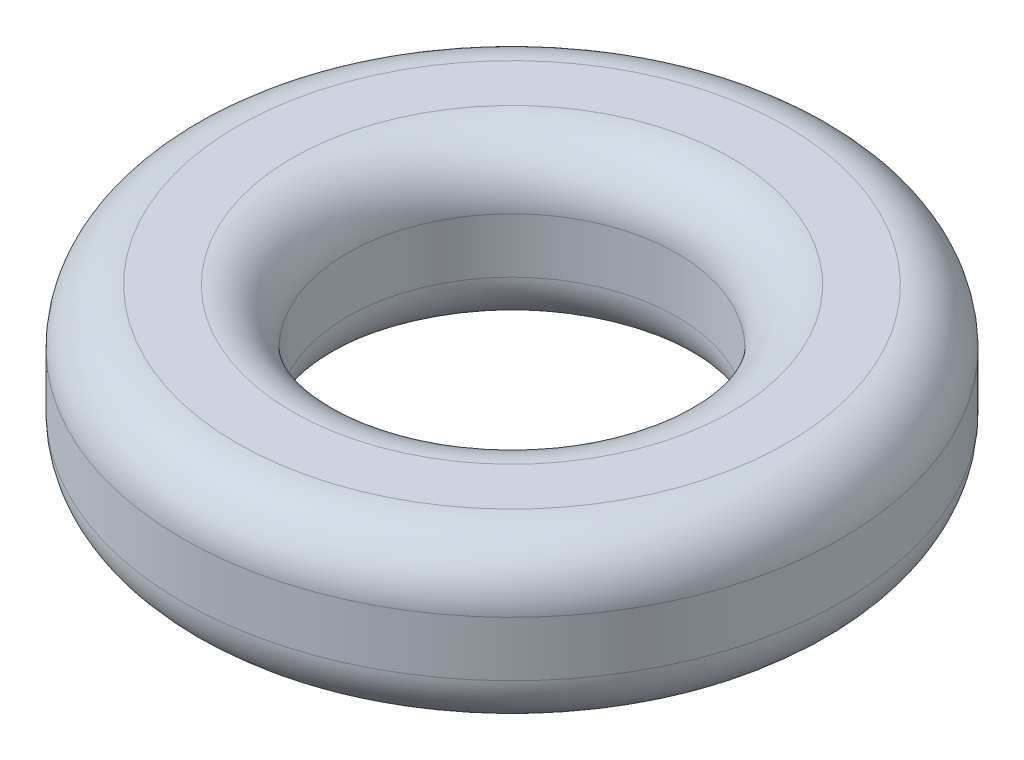
ISO-10303-21;
HEADER;
FILE_DESCRIPTION(('STEP AP214'),'2;1');
FILE_NAME('part.step','',(''),(''),'','','');
FILE_SCHEMA(('AUTOMOTIVE_DESIGN { 1 0 10303 214 1 1 1 1 }'));
ENDSEC;
DATA;
#1=APPLICATION_CONTEXT('core data for automotive mechanical design processes');
#2=APPLICATION_PROTOCOL_DEFINITION('international standard','automotive_design',2000,#1);
#3=PRODUCT_CONTEXT('',#1,'mechanical');
#4=PRODUCT('Part','Part','',(#3));
#5=PRODUCT_RELATED_PRODUCT_CATEGORY('part','',(#4));
#6=PRODUCT_DEFINITION_FORMATION('','',#4);
#7=PRODUCT_DEFINITION_CONTEXT('part definition',#1,'design');
#8=PRODUCT_DEFINITION('design','',#6,#7);
#9=PRODUCT_DEFINITION_SHAPE('','',#8);
#10=(LENGTH_UNIT() NAMED_UNIT(*) SI_UNIT(.MILLI.,.METRE.));
#11=(NAMED_UNIT(*) PLANE_ANGLE_UNIT() SI_UNIT($,.RADIAN.));
#12=(NAMED_UNIT(*) SI_UNIT($,.STERADIAN.) SOLID_ANGLE_UNIT());
#13=UNCERTAINTY_MEASURE_WITH_UNIT(LENGTH_MEASURE(1.E-05),#10,'distance_accuracy_value','');
#14=(GEOMETRIC_REPRESENTATION_CONTEXT(3) GLOBAL_UNCERTAINTY_ASSIGNED_CONTEXT((#13)) GLOBAL_UNIT_ASSIGNED_CONTEXT((#10,
#11,#12)) REPRESENTATION_CONTEXT('',''));
#15=CARTESIAN_POINT('',(0.,0.,0.));
#16=DIRECTION('',(0.,0.,1.));
#17=DIRECTION('',(1.,0.,0.));
#18=AXIS2_PLACEMENT_3D('',#15,#16,#17);
#19=CARTESIAN_POINT('',(0.,0.75,0.));
#20=DIRECTION('',(0.,1.,0.));
#21=DIRECTION('',(0.,0.,1.));
#22=AXIS2_PLACEMENT_3D('',#19,#20,#21);
#23=PLANE('',#22);
#24=CARTESIAN_POINT('',(0.,0.75,0.));
#25=DIRECTION('',(0.,1.,0.));
#26=DIRECTION('',(0.,0.,1.));
#27=AXIS2_PLACEMENT_3D('',#24,#25,#26);
#28=CIRCLE('',#27,2.);
#29=CARTESIAN_POINT('',(0.,0.75,2.));
#30=VERTEX_POINT('',#29);
#31=EDGE_CURVE('E10',#30,#30,#28,.F.);
#32=ORIENTED_EDGE('',*,*,#31,.T.);
#33=EDGE_LOOP('',(#32));
#34=FACE_BOUND('',#33,.T.);
#35=CARTESIAN_POINT('',(0.,0.75,0.));
#36=DIRECTION('',(0.,1.,0.));
#37=DIRECTION('',(0.,0.,1.));
#38=AXIS2_PLACEMENT_3D('',#35,#36,#37);
#39=CIRCLE('',#38,2.5);
#40=CARTESIAN_POINT('',(0.,0.75,2.5));
#41=VERTEX_POINT('',#40);
#42=EDGE_CURVE('E21',#41,#41,#39,.T.);
#43=ORIENTED_EDGE('',*,*,#42,.T.);
#44=EDGE_LOOP('',(#43));
#45=FACE_BOUND('',#44,.T.);
#46=ADVANCED_FACE('F14',(#34,#45),#23,.T.);
#47=CARTESIAN_POINT('',(0.,-0.75,0.));
#48=DIRECTION('',(0.,1.,0.));
#49=DIRECTION('',(0.,0.,1.));
#50=AXIS2_PLACEMENT_3D('',#47,#48,#49);
#51=PLANE('',#50);
#52=CARTESIAN_POINT('',(0.,-0.75,0.));
#53=DIRECTION('',(0.,1.,0.));
#54=DIRECTION('',(0.,0.,1.));
#55=AXIS2_PLACEMENT_3D('',#52,#53,#54);
#56=CIRCLE('',#55,2.);
#57=CARTESIAN_POINT('',(0.,-0.75,2.));
#58=VERTEX_POINT('',#57);
#59=EDGE_CURVE('E40',#58,#58,#56,.T.);
#60=ORIENTED_EDGE('',*,*,#59,.T.);
#61=EDGE_LOOP('',(#60));
#62=FACE_BOUND('',#61,.T.);
#63=CARTESIAN_POINT('',(0.,-0.75,0.));
#64=DIRECTION('',(0.,1.,0.));
#65=DIRECTION('',(0.,0.,1.));
#66=AXIS2_PLACEMENT_3D('',#63,#64,#65);
#67=CIRCLE('',#66,2.5);
#68=CARTESIAN_POINT('',(0.,-0.75,2.5));
#69=VERTEX_POINT('',#68);
#70=EDGE_CURVE('E43',#69,#69,#67,.F.);
#71=ORIENTED_EDGE('',*,*,#70,.T.);
#72=EDGE_LOOP('',(#71));
#73=FACE_BOUND('',#72,.T.);
#74=ADVANCED_FACE('F47',(#62,#73),#51,.F.);
#75=CARTESIAN_POINT('',(0.,0.75,0.));
#76=DIRECTION('',(0.,-1.,0.));
#77=DIRECTION('',(0.,0.,-1.));
#78=AXIS2_PLACEMENT_3D('',#75,#76,#77);
#79=CYLINDRICAL_SURFACE('',#78,3.);
#80=CARTESIAN_POINT('',(0.,-0.25,0.));
#81=DIRECTION('',(0.,1.,0.));
#82=DIRECTION('',(0.,0.,1.));
#83=AXIS2_PLACEMENT_3D('',#80,#81,#82);
#84=CIRCLE('',#83,3.);
#85=CARTESIAN_POINT('',(0.,-0.25,3.));
#86=VERTEX_POINT('',#85);
#87=EDGE_CURVE('E25',#86,#86,#84,.T.);
#88=ORIENTED_EDGE('',*,*,#87,.T.);
#89=EDGE_LOOP('',(#88));
#90=FACE_BOUND('',#89,.T.);
#91=CARTESIAN_POINT('',(0.,0.25,0.));
#92=DIRECTION('',(0.,1.,0.));
#93=DIRECTION('',(0.,0.,1.));
#94=AXIS2_PLACEMENT_3D('',#91,#92,#93);
#95=CIRCLE('',#94,3.);
#96=CARTESIAN_POINT('',(0.,0.25,3.));
#97=VERTEX_POINT('',#96);
#98=EDGE_CURVE('E29',#97,#97,#95,.F.);
#99=ORIENTED_EDGE('',*,*,#98,.T.);
#100=EDGE_LOOP('',(#99));
#101=FACE_BOUND('',#100,.T.);
#102=ADVANCED_FACE('F57',(#90,#101),#79,.T.);
#103=CARTESIAN_POINT('',(0.,0.75,0.));
#104=DIRECTION('',(0.,-1.,0.));
#105=DIRECTION('',(0.,0.,-1.));
#106=AXIS2_PLACEMENT_3D('',#103,#104,#105);
#107=CYLINDRICAL_SURFACE('',#106,1.5);
#108=CARTESIAN_POINT('',(0.,-0.25,0.));
#109=DIRECTION('',(0.,1.,0.));
#110=DIRECTION('',(0.,0.,1.));
#111=AXIS2_PLACEMENT_3D('',#108,#109,#110);
#112=CIRCLE('',#111,1.5);
#113=CARTESIAN_POINT('',(0.,-0.25,1.5));
#114=VERTEX_POINT('',#113);
#115=EDGE_CURVE('E34',#114,#114,#112,.F.);
#116=ORIENTED_EDGE('',*,*,#115,.T.);
#117=EDGE_LOOP('',(#116));
#118=FACE_BOUND('',#117,.T.);
#119=CARTESIAN_POINT('',(0.,0.25,0.));
#120=DIRECTION('',(0.,1.,0.));
#121=DIRECTION('',(0.,0.,1.));
#122=AXIS2_PLACEMENT_3D('',#119,#120,#121);
#123=CIRCLE('',#122,1.5);
#124=CARTESIAN_POINT('',(0.,0.25,1.5));
#125=VERTEX_POINT('',#124);
#126=EDGE_CURVE('E37',#125,#125,#123,.T.);
#127=ORIENTED_EDGE('',*,*,#126,.T.);
#128=EDGE_LOOP('',(#127));
#129=FACE_BOUND('',#128,.T.);
#130=ADVANCED_FACE('F60',(#118,#129),#107,.F.);
#131=CARTESIAN_POINT('',(0.,-0.25,0.));
#132=DIRECTION('',(0.,1.,0.));
#133=DIRECTION('',(0.,0.,1.));
#134=AXIS2_PLACEMENT_3D('',#131,#132,#133);
#135=TOROIDAL_SURFACE('',#134,2.,0.5);
#136=ORIENTED_EDGE('',*,*,#115,.F.);
#137=EDGE_LOOP('',(#136));
#138=FACE_BOUND('',#137,.T.);
#139=ORIENTED_EDGE('',*,*,#59,.F.);
#140=EDGE_LOOP('',(#139));
#141=FACE_BOUND('',#140,.T.);
#142=ADVANCED_FACE('F53',(#138,#141),#135,.T.);
#143=CARTESIAN_POINT('',(0.,-0.25,0.));
#144=DIRECTION('',(0.,1.,0.));
#145=DIRECTION('',(0.,0.,1.));
#146=AXIS2_PLACEMENT_3D('',#143,#144,#145);
#147=TOROIDAL_SURFACE('',#146,2.5,0.5);
#148=ORIENTED_EDGE('',*,*,#70,.F.);
#149=EDGE_LOOP('',(#148));
#150=FACE_BOUND('',#149,.T.);
#151=ORIENTED_EDGE('',*,*,#87,.F.);
#152=EDGE_LOOP('',(#151));
#153=FACE_BOUND('',#152,.T.);
#154=ADVANCED_FACE('F49',(#150,#153),#147,.T.);
#155=CARTESIAN_POINT('',(0.,0.25,0.));
#156=DIRECTION('',(0.,1.,0.));
#157=DIRECTION('',(0.,0.,1.));
#158=AXIS2_PLACEMENT_3D('',#155,#156,#157);
#159=TOROIDAL_SURFACE('',#158,2.,0.5);
#160=ORIENTED_EDGE('',*,*,#31,.F.);
#161=EDGE_LOOP('',(#160));
#162=FACE_BOUND('',#161,.T.);
#163=ORIENTED_EDGE('',*,*,#126,.F.);
#164=EDGE_LOOP('',(#163));
#165=FACE_BOUND('',#164,.T.);
#166=ADVANCED_FACE('F52',(#162,#165),#159,.T.);
#167=CARTESIAN_POINT('',(0.,0.25,0.));
#168=DIRECTION('',(0.,1.,0.));
#169=DIRECTION('',(0.,0.,1.));
#170=AXIS2_PLACEMENT_3D('',#167,#168,#169);
#171=TOROIDAL_SURFACE('',#170,2.5,0.5);
#172=ORIENTED_EDGE('',*,*,#98,.F.);
#173=EDGE_LOOP('',(#172));
#174=FACE_BOUND('',#173,.T.);
#175=ORIENTED_EDGE('',*,*,#42,.F.);
#176=EDGE_LOOP('',(#175));
#177=FACE_BOUND('',#176,.T.);
#178=ADVANCED_FACE('F16',(#174,#177),#171,.T.);
#179=CLOSED_SHELL('',(#46,#74,#102,#130,#142,#154,#166,#178));
#180=MANIFOLD_SOLID_BREP('B1',#179);
#181=ADVANCED_BREP_SHAPE_REPRESENTATION('',(#18,#180),#14);
#182=SHAPE_DEFINITION_REPRESENTATION(#9,#181);
ENDSEC;
END-ISO-10303-21;
